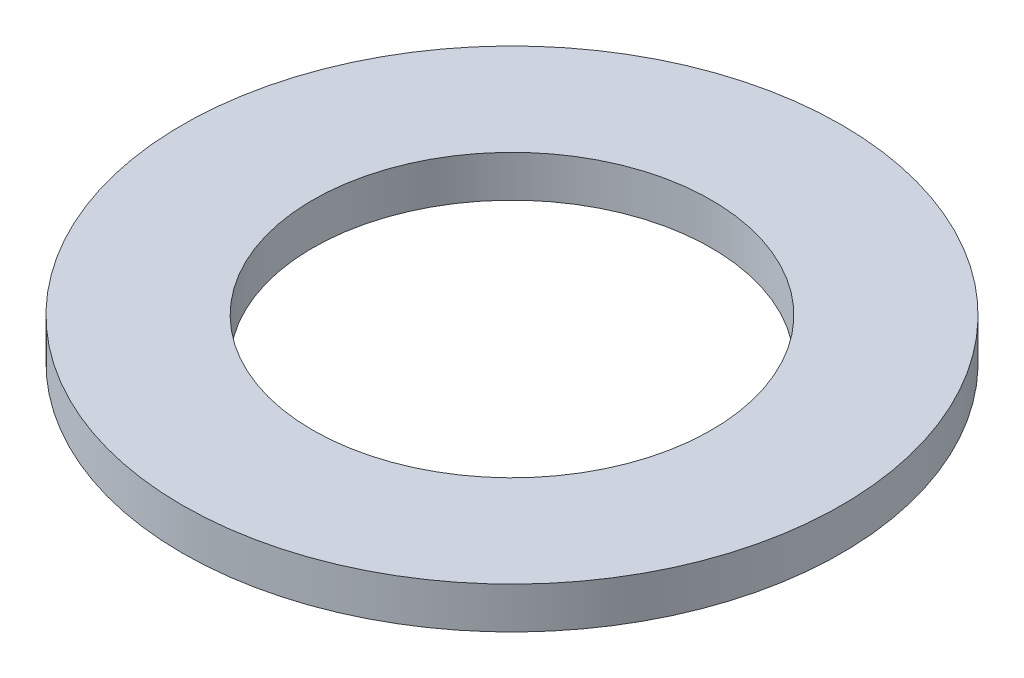
ISO-10303-21;
HEADER;
FILE_DESCRIPTION(('STEP AP214'),'2;1');
FILE_NAME('part.step','',(''),(''),'','','');
FILE_SCHEMA(('AUTOMOTIVE_DESIGN { 1 0 10303 214 1 1 1 1 }'));
ENDSEC;
DATA;
#1=APPLICATION_CONTEXT('core data for automotive mechanical design processes');
#2=APPLICATION_PROTOCOL_DEFINITION('international standard','automotive_design',2000,#1);
#3=PRODUCT_CONTEXT('',#1,'mechanical');
#4=PRODUCT('Part','Part','',(#3));
#5=PRODUCT_RELATED_PRODUCT_CATEGORY('part','',(#4));
#6=PRODUCT_DEFINITION_FORMATION('','',#4);
#7=PRODUCT_DEFINITION_CONTEXT('part definition',#1,'design');
#8=PRODUCT_DEFINITION('design','',#6,#7);
#9=PRODUCT_DEFINITION_SHAPE('','',#8);
#10=(LENGTH_UNIT() NAMED_UNIT(*) SI_UNIT(.MILLI.,.METRE.));
#11=(NAMED_UNIT(*) PLANE_ANGLE_UNIT() SI_UNIT($,.RADIAN.));
#12=(NAMED_UNIT(*) SI_UNIT($,.STERADIAN.) SOLID_ANGLE_UNIT());
#13=UNCERTAINTY_MEASURE_WITH_UNIT(LENGTH_MEASURE(1.E-05),#10,'distance_accuracy_value','');
#14=(GEOMETRIC_REPRESENTATION_CONTEXT(3) GLOBAL_UNCERTAINTY_ASSIGNED_CONTEXT((#13)) GLOBAL_UNIT_ASSIGNED_CONTEXT((#10,
#11,#12)) REPRESENTATION_CONTEXT('',''));
#15=CARTESIAN_POINT('',(0.,0.,0.));
#16=DIRECTION('',(0.,0.,1.));
#17=DIRECTION('',(1.,0.,0.));
#18=AXIS2_PLACEMENT_3D('',#15,#16,#17);
#19=CARTESIAN_POINT('',(0.,1.9812,0.));
#20=DIRECTION('',(0.,-1.,0.));
#21=DIRECTION('',(0.,0.,-1.));
#22=AXIS2_PLACEMENT_3D('',#19,#20,#21);
#23=CYLINDRICAL_SURFACE('',#22,15.748);
#24=CARTESIAN_POINT('',(0.,1.9812,0.));
#25=DIRECTION('',(0.,1.,0.));
#26=DIRECTION('',(0.,0.,1.));
#27=AXIS2_PLACEMENT_3D('',#24,#25,#26);
#28=CIRCLE('',#27,15.748);
#29=CARTESIAN_POINT('',(0.,1.9812,15.748));
#30=VERTEX_POINT('',#29);
#31=EDGE_CURVE('E10',#30,#30,#28,.T.);
#32=ORIENTED_EDGE('',*,*,#31,.F.);
#33=EDGE_LOOP('',(#32));
#34=FACE_BOUND('',#33,.T.);
#35=CARTESIAN_POINT('',(0.,0.,0.));
#36=DIRECTION('',(0.,1.,0.));
#37=DIRECTION('',(0.,0.,1.));
#38=AXIS2_PLACEMENT_3D('',#35,#36,#37);
#39=CIRCLE('',#38,15.748);
#40=CARTESIAN_POINT('',(0.,0.,15.748));
#41=VERTEX_POINT('',#40);
#42=EDGE_CURVE('E38',#41,#41,#39,.T.);
#43=ORIENTED_EDGE('',*,*,#42,.T.);
#44=EDGE_LOOP('',(#43));
#45=FACE_BOUND('',#44,.T.);
#46=ADVANCED_FACE('F31',(#34,#45),#23,.T.);
#47=CARTESIAN_POINT('',(0.,1.9812,0.));
#48=DIRECTION('',(0.,1.,0.));
#49=DIRECTION('',(0.,0.,1.));
#50=AXIS2_PLACEMENT_3D('',#47,#48,#49);
#51=PLANE('',#50);
#52=CARTESIAN_POINT('',(0.,1.9812,0.));
#53=DIRECTION('',(0.,1.,0.));
#54=DIRECTION('',(0.,0.,1.));
#55=AXIS2_PLACEMENT_3D('',#52,#53,#54);
#56=CIRCLE('',#55,9.525);
#57=CARTESIAN_POINT('',(0.,1.9812,9.525));
#58=VERTEX_POINT('',#57);
#59=EDGE_CURVE('E44',#58,#58,#56,.T.);
#60=ORIENTED_EDGE('',*,*,#59,.F.);
#61=EDGE_LOOP('',(#60));
#62=FACE_BOUND('',#61,.T.);
#63=ORIENTED_EDGE('',*,*,#31,.T.);
#64=EDGE_LOOP('',(#63));
#65=FACE_BOUND('',#64,.T.);
#66=ADVANCED_FACE('F60',(#62,#65),#51,.T.);
#67=CARTESIAN_POINT('',(0.,0.,0.));
#68=DIRECTION('',(0.,1.,0.));
#69=DIRECTION('',(0.,0.,1.));
#70=AXIS2_PLACEMENT_3D('',#67,#68,#69);
#71=PLANE('',#70);
#72=CARTESIAN_POINT('',(0.,0.,0.));
#73=DIRECTION('',(0.,1.,0.));
#74=DIRECTION('',(0.,0.,1.));
#75=AXIS2_PLACEMENT_3D('',#72,#73,#74);
#76=CIRCLE('',#75,9.525);
#77=CARTESIAN_POINT('',(0.,0.,9.525));
#78=VERTEX_POINT('',#77);
#79=EDGE_CURVE('E34',#78,#78,#76,.T.);
#80=ORIENTED_EDGE('',*,*,#79,.T.);
#81=EDGE_LOOP('',(#80));
#82=FACE_BOUND('',#81,.T.);
#83=ORIENTED_EDGE('',*,*,#42,.F.);
#84=EDGE_LOOP('',(#83));
#85=FACE_BOUND('',#84,.T.);
#86=ADVANCED_FACE('F51',(#82,#85),#71,.F.);
#87=CARTESIAN_POINT('',(0.,-2.54,0.));
#88=DIRECTION('',(0.,1.,0.));
#89=DIRECTION('',(0.,0.,1.));
#90=AXIS2_PLACEMENT_3D('',#87,#88,#89);
#91=CYLINDRICAL_SURFACE('',#90,9.525);
#92=ORIENTED_EDGE('',*,*,#59,.T.);
#93=EDGE_LOOP('',(#92));
#94=FACE_BOUND('',#93,.T.);
#95=ORIENTED_EDGE('',*,*,#79,.F.);
#96=EDGE_LOOP('',(#95));
#97=FACE_BOUND('',#96,.T.);
#98=ADVANCED_FACE('F54',(#94,#97),#91,.F.);
#99=CLOSED_SHELL('',(#46,#66,#86,#98));
#100=MANIFOLD_SOLID_BREP('B2',#99);
#101=ADVANCED_BREP_SHAPE_REPRESENTATION('',(#18,#100),#14);
#102=SHAPE_DEFINITION_REPRESENTATION(#9,#101);
ENDSEC;
END-ISO-10303-21;
